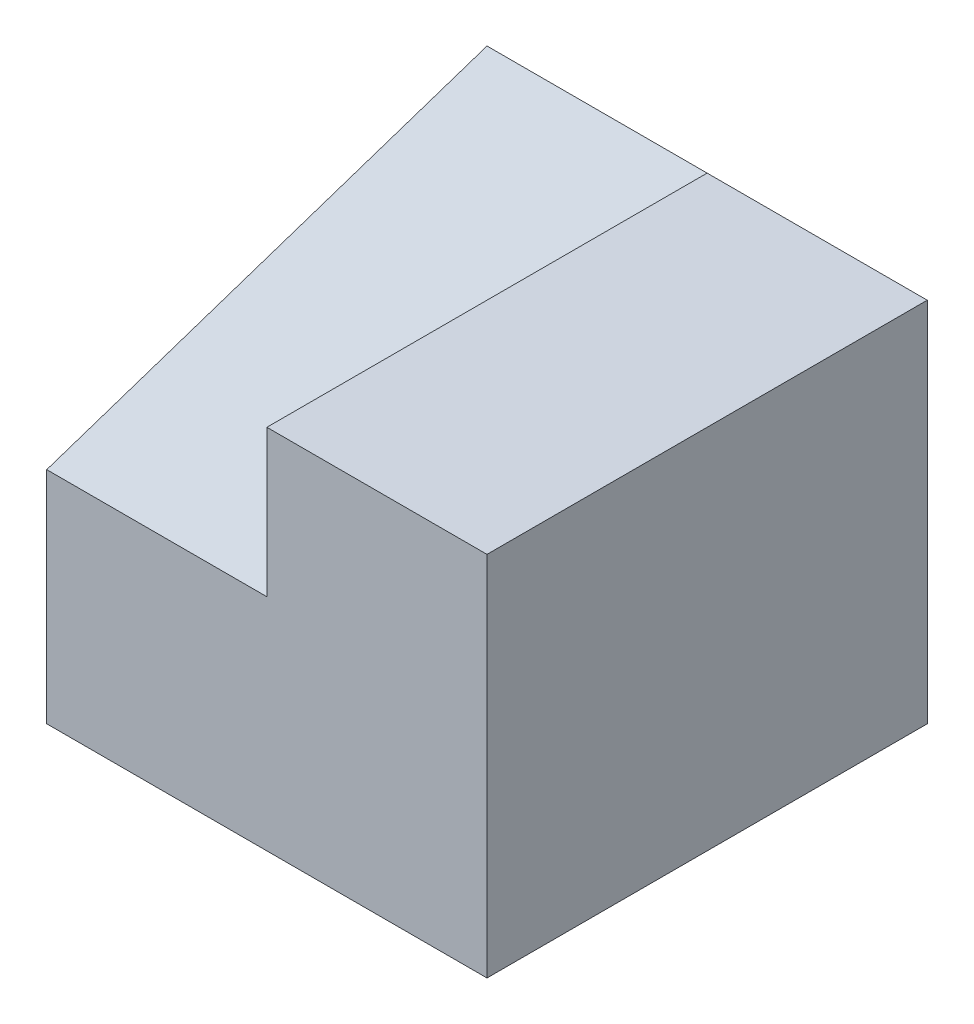
ISO-10303-21;
HEADER;
FILE_DESCRIPTION(('STEP AP214'),'2;1');
FILE_NAME('part.step','',(''),(''),'','','');
FILE_SCHEMA(('AUTOMOTIVE_DESIGN { 1 0 10303 214 1 1 1 1 }'));
ENDSEC;
DATA;
#1=APPLICATION_CONTEXT('core data for automotive mechanical design processes');
#2=APPLICATION_PROTOCOL_DEFINITION('international standard','automotive_design',2000,#1);
#3=PRODUCT_CONTEXT('',#1,'mechanical');
#4=PRODUCT('Part','Part','',(#3));
#5=PRODUCT_RELATED_PRODUCT_CATEGORY('part','',(#4));
#6=PRODUCT_DEFINITION_FORMATION('','',#4);
#7=PRODUCT_DEFINITION_CONTEXT('part definition',#1,'design');
#8=PRODUCT_DEFINITION('design','',#6,#7);
#9=PRODUCT_DEFINITION_SHAPE('','',#8);
#10=(LENGTH_UNIT() NAMED_UNIT(*) SI_UNIT(.MILLI.,.METRE.));
#11=(NAMED_UNIT(*) PLANE_ANGLE_UNIT() SI_UNIT($,.RADIAN.));
#12=(NAMED_UNIT(*) SI_UNIT($,.STERADIAN.) SOLID_ANGLE_UNIT());
#13=UNCERTAINTY_MEASURE_WITH_UNIT(LENGTH_MEASURE(1.E-05),#10,'distance_accuracy_value','');
#14=(GEOMETRIC_REPRESENTATION_CONTEXT(3) GLOBAL_UNCERTAINTY_ASSIGNED_CONTEXT((#13)) GLOBAL_UNIT_ASSIGNED_CONTEXT((#10,
#11,#12)) REPRESENTATION_CONTEXT('',''));
#15=CARTESIAN_POINT('',(0.,0.,0.));
#16=DIRECTION('',(0.,0.,1.));
#17=DIRECTION('',(1.,0.,0.));
#18=AXIS2_PLACEMENT_3D('',#15,#16,#17);
#19=CARTESIAN_POINT('',(0.,0.,6.));
#20=DIRECTION('',(1.,0.,0.));
#21=DIRECTION('',(0.,0.,-1.));
#22=AXIS2_PLACEMENT_3D('',#19,#20,#21);
#23=PLANE('',#22);
#24=DIRECTION('',(0.,-1.,0.));
#25=VECTOR('',#24,1.);
#26=CARTESIAN_POINT('',(0.,0.,6.));
#27=LINE('',#26,#25);
#28=CARTESIAN_POINT('',(0.,3.,6.));
#29=VERTEX_POINT('',#28);
#30=CARTESIAN_POINT('',(0.,0.,6.));
#31=VERTEX_POINT('',#30);
#32=EDGE_CURVE('E78',#29,#31,#27,.T.);
#33=ORIENTED_EDGE('',*,*,#32,.F.);
#34=DIRECTION('',(0.,-0.316227766016838,0.948683298050514));
#35=VECTOR('',#34,1.);
#36=CARTESIAN_POINT('',(0.,5.,0.));
#37=LINE('',#36,#35);
#38=CARTESIAN_POINT('',(0.,5.,0.));
#39=VERTEX_POINT('',#38);
#40=EDGE_CURVE('E96',#39,#29,#37,.T.);
#41=ORIENTED_EDGE('',*,*,#40,.F.);
#42=DIRECTION('',(0.,-1.,0.));
#43=VECTOR('',#42,1.);
#44=CARTESIAN_POINT('',(0.,0.,0.));
#45=LINE('',#44,#43);
#46=CARTESIAN_POINT('',(0.,0.,0.));
#47=VERTEX_POINT('',#46);
#48=EDGE_CURVE('E98',#39,#47,#45,.T.);
#49=ORIENTED_EDGE('',*,*,#48,.T.);
#50=DIRECTION('',(0.,0.,-1.));
#51=VECTOR('',#50,1.);
#52=CARTESIAN_POINT('',(0.,0.,6.));
#53=LINE('',#52,#51);
#54=EDGE_CURVE('E11',#31,#47,#53,.T.);
#55=ORIENTED_EDGE('',*,*,#54,.F.);
#56=EDGE_LOOP('',(#33,#41,#49,#55));
#57=FACE_BOUND('',#56,.T.);
#58=ADVANCED_FACE('F33',(#57),#23,.F.);
#59=CARTESIAN_POINT('',(0.,0.,6.));
#60=DIRECTION('',(0.,1.,0.));
#61=DIRECTION('',(0.,0.,1.));
#62=AXIS2_PLACEMENT_3D('',#59,#60,#61);
#63=PLANE('',#62);
#64=DIRECTION('',(1.,0.,0.));
#65=VECTOR('',#64,1.);
#66=CARTESIAN_POINT('',(0.,0.,0.));
#67=LINE('',#66,#65);
#68=CARTESIAN_POINT('',(6.,0.,0.));
#69=VERTEX_POINT('',#68);
#70=EDGE_CURVE('E121',#47,#69,#67,.T.);
#71=ORIENTED_EDGE('',*,*,#70,.T.);
#72=DIRECTION('',(0.,0.,-1.));
#73=VECTOR('',#72,1.);
#74=CARTESIAN_POINT('',(6.,0.,6.));
#75=LINE('',#74,#73);
#76=CARTESIAN_POINT('',(6.,0.,6.));
#77=VERTEX_POINT('',#76);
#78=EDGE_CURVE('E40',#77,#69,#75,.T.);
#79=ORIENTED_EDGE('',*,*,#78,.F.);
#80=DIRECTION('',(1.,0.,0.));
#81=VECTOR('',#80,1.);
#82=CARTESIAN_POINT('',(0.,0.,6.));
#83=LINE('',#82,#81);
#84=EDGE_CURVE('E113',#31,#77,#83,.T.);
#85=ORIENTED_EDGE('',*,*,#84,.F.);
#86=ORIENTED_EDGE('',*,*,#54,.T.);
#87=EDGE_LOOP('',(#71,#79,#85,#86));
#88=FACE_BOUND('',#87,.T.);
#89=ADVANCED_FACE('F142',(#88),#63,.F.);
#90=CARTESIAN_POINT('',(6.,0.,6.));
#91=DIRECTION('',(-1.,0.,0.));
#92=DIRECTION('',(0.,0.,1.));
#93=AXIS2_PLACEMENT_3D('',#90,#91,#92);
#94=PLANE('',#93);
#95=DIRECTION('',(0.,1.,0.));
#96=VECTOR('',#95,1.);
#97=CARTESIAN_POINT('',(6.,0.,0.));
#98=LINE('',#97,#96);
#99=CARTESIAN_POINT('',(6.,5.,0.));
#100=VERTEX_POINT('',#99);
#101=EDGE_CURVE('E73',#69,#100,#98,.T.);
#102=ORIENTED_EDGE('',*,*,#101,.T.);
#103=DIRECTION('',(0.,0.,-1.));
#104=VECTOR('',#103,1.);
#105=CARTESIAN_POINT('',(6.,5.,6.));
#106=LINE('',#105,#104);
#107=CARTESIAN_POINT('',(6.,5.,6.));
#108=VERTEX_POINT('',#107);
#109=EDGE_CURVE('E118',#108,#100,#106,.T.);
#110=ORIENTED_EDGE('',*,*,#109,.F.);
#111=DIRECTION('',(0.,1.,0.));
#112=VECTOR('',#111,1.);
#113=CARTESIAN_POINT('',(6.,0.,6.));
#114=LINE('',#113,#112);
#115=EDGE_CURVE('E56',#77,#108,#114,.T.);
#116=ORIENTED_EDGE('',*,*,#115,.F.);
#117=ORIENTED_EDGE('',*,*,#78,.T.);
#118=EDGE_LOOP('',(#102,#110,#116,#117));
#119=FACE_BOUND('',#118,.T.);
#120=ADVANCED_FACE('F127',(#119),#94,.F.);
#121=CARTESIAN_POINT('',(0.,5.,6.));
#122=DIRECTION('',(0.,-1.,0.));
#123=DIRECTION('',(0.,0.,-1.));
#124=AXIS2_PLACEMENT_3D('',#121,#122,#123);
#125=PLANE('',#124);
#126=DIRECTION('',(-1.,0.,0.));
#127=VECTOR('',#126,1.);
#128=CARTESIAN_POINT('',(0.,5.,0.));
#129=LINE('',#128,#127);
#130=CARTESIAN_POINT('',(3.,5.,0.));
#131=VERTEX_POINT('',#130);
#132=EDGE_CURVE('E114',#100,#131,#129,.T.);
#133=ORIENTED_EDGE('',*,*,#132,.T.);
#134=DIRECTION('',(0.,0.,-1.));
#135=VECTOR('',#134,1.);
#136=CARTESIAN_POINT('',(3.,5.,6.));
#137=LINE('',#136,#135);
#138=CARTESIAN_POINT('',(3.,5.,6.));
#139=VERTEX_POINT('',#138);
#140=EDGE_CURVE('E47',#139,#131,#137,.T.);
#141=ORIENTED_EDGE('',*,*,#140,.F.);
#142=DIRECTION('',(-1.,0.,0.));
#143=VECTOR('',#142,1.);
#144=CARTESIAN_POINT('',(0.,5.,6.));
#145=LINE('',#144,#143);
#146=EDGE_CURVE('E106',#108,#139,#145,.T.);
#147=ORIENTED_EDGE('',*,*,#146,.F.);
#148=ORIENTED_EDGE('',*,*,#109,.T.);
#149=EDGE_LOOP('',(#133,#141,#147,#148));
#150=FACE_BOUND('',#149,.T.);
#151=ADVANCED_FACE('F134',(#150),#125,.F.);
#152=CARTESIAN_POINT('',(0.,0.,6.));
#153=DIRECTION('',(0.,0.,-1.));
#154=DIRECTION('',(-1.,0.,0.));
#155=AXIS2_PLACEMENT_3D('',#152,#153,#154);
#156=PLANE('',#155);
#157=DIRECTION('',(0.,1.,0.));
#158=VECTOR('',#157,1.);
#159=CARTESIAN_POINT('',(3.,3.,6.));
#160=LINE('',#159,#158);
#161=CARTESIAN_POINT('',(3.,3.,6.));
#162=VERTEX_POINT('',#161);
#163=EDGE_CURVE('E102',#162,#139,#160,.T.);
#164=ORIENTED_EDGE('',*,*,#163,.F.);
#165=DIRECTION('',(-1.,0.,0.));
#166=VECTOR('',#165,1.);
#167=CARTESIAN_POINT('',(3.,3.,6.));
#168=LINE('',#167,#166);
#169=EDGE_CURVE('E91',#162,#29,#168,.T.);
#170=ORIENTED_EDGE('',*,*,#169,.T.);
#171=ORIENTED_EDGE('',*,*,#32,.T.);
#172=ORIENTED_EDGE('',*,*,#84,.T.);
#173=ORIENTED_EDGE('',*,*,#115,.T.);
#174=ORIENTED_EDGE('',*,*,#146,.T.);
#175=EDGE_LOOP('',(#164,#170,#171,#172,#173,#174));
#176=FACE_BOUND('',#175,.T.);
#177=ADVANCED_FACE('F104',(#176),#156,.F.);
#178=CARTESIAN_POINT('',(0.,0.,0.));
#179=DIRECTION('',(0.,0.,-1.));
#180=DIRECTION('',(-1.,0.,0.));
#181=AXIS2_PLACEMENT_3D('',#178,#179,#180);
#182=PLANE('',#181);
#183=ORIENTED_EDGE('',*,*,#48,.F.);
#184=DIRECTION('',(-1.,0.,0.));
#185=VECTOR('',#184,1.);
#186=CARTESIAN_POINT('',(3.,5.,0.));
#187=LINE('',#186,#185);
#188=EDGE_CURVE('E99',#131,#39,#187,.T.);
#189=ORIENTED_EDGE('',*,*,#188,.F.);
#190=ORIENTED_EDGE('',*,*,#132,.F.);
#191=ORIENTED_EDGE('',*,*,#101,.F.);
#192=ORIENTED_EDGE('',*,*,#70,.F.);
#193=EDGE_LOOP('',(#183,#189,#190,#191,#192));
#194=FACE_BOUND('',#193,.T.);
#195=ADVANCED_FACE('F132',(#194),#182,.T.);
#196=CARTESIAN_POINT('',(3.,5.,0.));
#197=DIRECTION('',(0.,-0.948683298050514,-0.316227766016838));
#198=DIRECTION('',(0.,0.316227766016838,-0.948683298050514));
#199=AXIS2_PLACEMENT_3D('',#196,#197,#198);
#200=PLANE('',#199);
#201=ORIENTED_EDGE('',*,*,#40,.T.);
#202=ORIENTED_EDGE('',*,*,#169,.F.);
#203=DIRECTION('',(0.,-0.316227766016838,0.948683298050514));
#204=VECTOR('',#203,1.);
#205=CARTESIAN_POINT('',(3.,5.,0.));
#206=LINE('',#205,#204);
#207=EDGE_CURVE('E93',#131,#162,#206,.T.);
#208=ORIENTED_EDGE('',*,*,#207,.F.);
#209=ORIENTED_EDGE('',*,*,#188,.T.);
#210=EDGE_LOOP('',(#201,#202,#208,#209));
#211=FACE_BOUND('',#210,.T.);
#212=ADVANCED_FACE('F92',(#211),#200,.F.);
#213=CARTESIAN_POINT('',(3.,0.,0.));
#214=DIRECTION('',(1.,0.,0.));
#215=DIRECTION('',(0.,0.,-1.));
#216=AXIS2_PLACEMENT_3D('',#213,#214,#215);
#217=PLANE('',#216);
#218=ORIENTED_EDGE('',*,*,#140,.T.);
#219=ORIENTED_EDGE('',*,*,#207,.T.);
#220=ORIENTED_EDGE('',*,*,#163,.T.);
#221=EDGE_LOOP('',(#218,#219,#220));
#222=FACE_BOUND('',#221,.T.);
#223=ADVANCED_FACE('F101',(#222),#217,.F.);
#224=CLOSED_SHELL('',(#58,#89,#120,#151,#177,#195,#212,#223));
#225=MANIFOLD_SOLID_BREP('B2',#224);
#226=ADVANCED_BREP_SHAPE_REPRESENTATION('',(#18,#225),#14);
#227=SHAPE_DEFINITION_REPRESENTATION(#9,#226);
ENDSEC;
END-ISO-10303-21;
